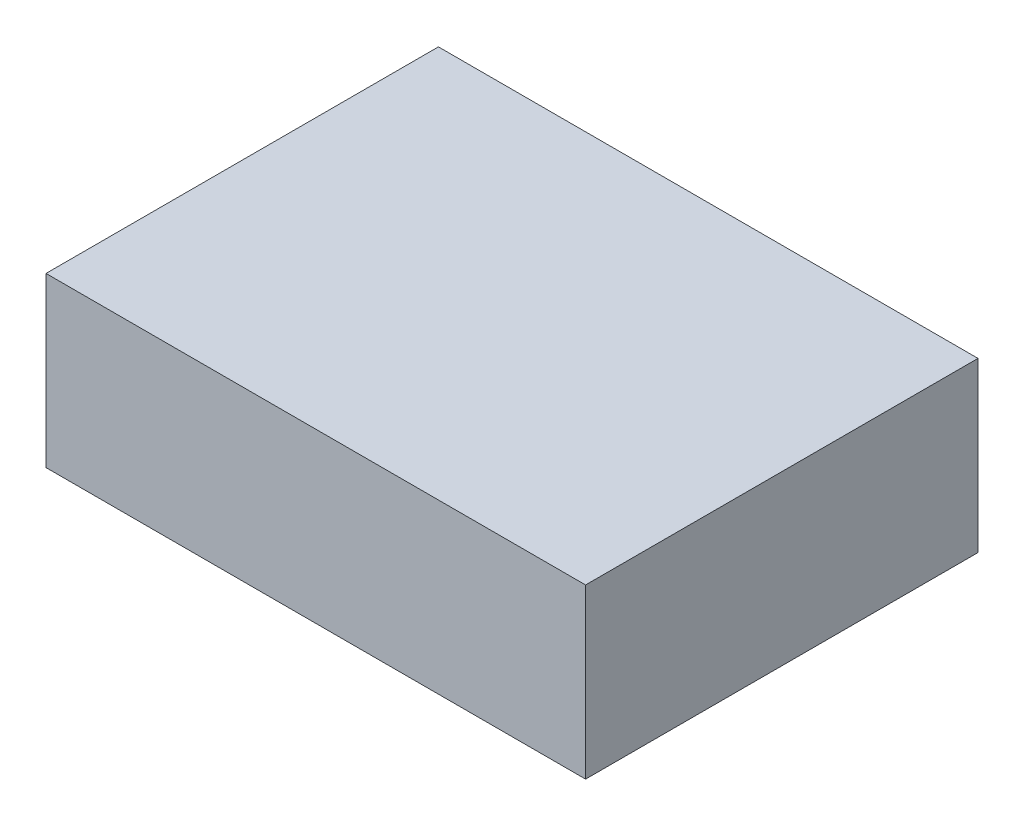
ISO-10303-21;
HEADER;
FILE_DESCRIPTION(('STEP AP214'),'2;1');
FILE_NAME('part.step','',(''),(''),'','','');
FILE_SCHEMA(('AUTOMOTIVE_DESIGN { 1 0 10303 214 1 1 1 1 }'));
ENDSEC;
DATA;
#1=APPLICATION_CONTEXT('core data for automotive mechanical design processes');
#2=APPLICATION_PROTOCOL_DEFINITION('international standard','automotive_design',2000,#1);
#3=PRODUCT_CONTEXT('',#1,'mechanical');
#4=PRODUCT('Part','Part','',(#3));
#5=PRODUCT_RELATED_PRODUCT_CATEGORY('part','',(#4));
#6=PRODUCT_DEFINITION_FORMATION('','',#4);
#7=PRODUCT_DEFINITION_CONTEXT('part definition',#1,'design');
#8=PRODUCT_DEFINITION('design','',#6,#7);
#9=PRODUCT_DEFINITION_SHAPE('','',#8);
#10=(LENGTH_UNIT() NAMED_UNIT(*) SI_UNIT(.MILLI.,.METRE.));
#11=(NAMED_UNIT(*) PLANE_ANGLE_UNIT() SI_UNIT($,.RADIAN.));
#12=(NAMED_UNIT(*) SI_UNIT($,.STERADIAN.) SOLID_ANGLE_UNIT());
#13=UNCERTAINTY_MEASURE_WITH_UNIT(LENGTH_MEASURE(1.E-05),#10,'distance_accuracy_value','');
#14=(GEOMETRIC_REPRESENTATION_CONTEXT(3) GLOBAL_UNCERTAINTY_ASSIGNED_CONTEXT((#13)) GLOBAL_UNIT_ASSIGNED_CONTEXT((#10,
#11,#12)) REPRESENTATION_CONTEXT('',''));
#15=CARTESIAN_POINT('',(0.,0.,0.));
#16=DIRECTION('',(0.,0.,1.));
#17=DIRECTION('',(1.,0.,0.));
#18=AXIS2_PLACEMENT_3D('',#15,#16,#17);
#19=CARTESIAN_POINT('',(0.,38.1,0.));
#20=DIRECTION('',(1.,0.,0.));
#21=DIRECTION('',(0.,0.,-1.));
#22=AXIS2_PLACEMENT_3D('',#19,#20,#21);
#23=PLANE('',#22);
#24=DIRECTION('',(0.,0.,1.));
#25=VECTOR('',#24,1.);
#26=CARTESIAN_POINT('',(0.,0.,0.));
#27=LINE('',#26,#25);
#28=CARTESIAN_POINT('',(0.,0.,-88.9));
#29=VERTEX_POINT('',#28);
#30=CARTESIAN_POINT('',(0.,0.,0.));
#31=VERTEX_POINT('',#30);
#32=EDGE_CURVE('E101',#29,#31,#27,.T.);
#33=ORIENTED_EDGE('',*,*,#32,.T.);
#34=DIRECTION('',(0.,-1.,0.));
#35=VECTOR('',#34,1.);
#36=CARTESIAN_POINT('',(0.,38.1,0.));
#37=LINE('',#36,#35);
#38=CARTESIAN_POINT('',(0.,38.1,0.));
#39=VERTEX_POINT('',#38);
#40=EDGE_CURVE('E11',#39,#31,#37,.T.);
#41=ORIENTED_EDGE('',*,*,#40,.F.);
#42=DIRECTION('',(0.,0.,1.));
#43=VECTOR('',#42,1.);
#44=CARTESIAN_POINT('',(0.,38.1,0.));
#45=LINE('',#44,#43);
#46=CARTESIAN_POINT('',(0.,38.1,-88.9));
#47=VERTEX_POINT('',#46);
#48=EDGE_CURVE('E89',#47,#39,#45,.T.);
#49=ORIENTED_EDGE('',*,*,#48,.F.);
#50=DIRECTION('',(0.,-1.,0.));
#51=VECTOR('',#50,1.);
#52=CARTESIAN_POINT('',(0.,38.1,-88.9));
#53=LINE('',#52,#51);
#54=EDGE_CURVE('E97',#47,#29,#53,.T.);
#55=ORIENTED_EDGE('',*,*,#54,.T.);
#56=EDGE_LOOP('',(#33,#41,#49,#55));
#57=FACE_BOUND('',#56,.T.);
#58=ADVANCED_FACE('F38',(#57),#23,.F.);
#59=CARTESIAN_POINT('',(0.,38.1,0.));
#60=DIRECTION('',(0.,0.,-1.));
#61=DIRECTION('',(-1.,0.,0.));
#62=AXIS2_PLACEMENT_3D('',#59,#60,#61);
#63=PLANE('',#62);
#64=DIRECTION('',(1.,0.,0.));
#65=VECTOR('',#64,1.);
#66=CARTESIAN_POINT('',(0.,0.,0.));
#67=LINE('',#66,#65);
#68=CARTESIAN_POINT('',(122.2375,0.,0.));
#69=VERTEX_POINT('',#68);
#70=EDGE_CURVE('E93',#31,#69,#67,.T.);
#71=ORIENTED_EDGE('',*,*,#70,.T.);
#72=DIRECTION('',(0.,-1.,0.));
#73=VECTOR('',#72,1.);
#74=CARTESIAN_POINT('',(122.2375,38.1,0.));
#75=LINE('',#74,#73);
#76=CARTESIAN_POINT('',(122.2375,38.1,0.));
#77=VERTEX_POINT('',#76);
#78=EDGE_CURVE('E46',#77,#69,#75,.T.);
#79=ORIENTED_EDGE('',*,*,#78,.F.);
#80=DIRECTION('',(1.,0.,0.));
#81=VECTOR('',#80,1.);
#82=CARTESIAN_POINT('',(0.,38.1,0.));
#83=LINE('',#82,#81);
#84=EDGE_CURVE('E84',#39,#77,#83,.T.);
#85=ORIENTED_EDGE('',*,*,#84,.F.);
#86=ORIENTED_EDGE('',*,*,#40,.T.);
#87=EDGE_LOOP('',(#71,#79,#85,#86));
#88=FACE_BOUND('',#87,.T.);
#89=ADVANCED_FACE('F92',(#88),#63,.F.);
#90=CARTESIAN_POINT('',(122.2375,38.1,0.));
#91=DIRECTION('',(-1.,0.,0.));
#92=DIRECTION('',(0.,0.,1.));
#93=AXIS2_PLACEMENT_3D('',#90,#91,#92);
#94=PLANE('',#93);
#95=DIRECTION('',(0.,0.,-1.));
#96=VECTOR('',#95,1.);
#97=CARTESIAN_POINT('',(122.2375,0.,0.));
#98=LINE('',#97,#96);
#99=CARTESIAN_POINT('',(122.2375,0.,-88.9));
#100=VERTEX_POINT('',#99);
#101=EDGE_CURVE('E71',#69,#100,#98,.T.);
#102=ORIENTED_EDGE('',*,*,#101,.T.);
#103=DIRECTION('',(0.,-1.,0.));
#104=VECTOR('',#103,1.);
#105=CARTESIAN_POINT('',(122.2375,38.1,-88.9));
#106=LINE('',#105,#104);
#107=CARTESIAN_POINT('',(122.2375,38.1,-88.9));
#108=VERTEX_POINT('',#107);
#109=EDGE_CURVE('E94',#108,#100,#106,.T.);
#110=ORIENTED_EDGE('',*,*,#109,.F.);
#111=DIRECTION('',(0.,0.,-1.));
#112=VECTOR('',#111,1.);
#113=CARTESIAN_POINT('',(122.2375,38.1,0.));
#114=LINE('',#113,#112);
#115=EDGE_CURVE('E87',#77,#108,#114,.T.);
#116=ORIENTED_EDGE('',*,*,#115,.F.);
#117=ORIENTED_EDGE('',*,*,#78,.T.);
#118=EDGE_LOOP('',(#102,#110,#116,#117));
#119=FACE_BOUND('',#118,.T.);
#120=ADVANCED_FACE('F95',(#119),#94,.F.);
#121=CARTESIAN_POINT('',(0.,38.1,-88.9));
#122=DIRECTION('',(0.,0.,1.));
#123=DIRECTION('',(1.,0.,0.));
#124=AXIS2_PLACEMENT_3D('',#121,#122,#123);
#125=PLANE('',#124);
#126=DIRECTION('',(-1.,0.,0.));
#127=VECTOR('',#126,1.);
#128=CARTESIAN_POINT('',(0.,0.,-88.9));
#129=LINE('',#128,#127);
#130=EDGE_CURVE('E77',#100,#29,#129,.T.);
#131=ORIENTED_EDGE('',*,*,#130,.T.);
#132=ORIENTED_EDGE('',*,*,#54,.F.);
#133=DIRECTION('',(-1.,0.,0.));
#134=VECTOR('',#133,1.);
#135=CARTESIAN_POINT('',(0.,38.1,-88.9));
#136=LINE('',#135,#134);
#137=EDGE_CURVE('E54',#108,#47,#136,.T.);
#138=ORIENTED_EDGE('',*,*,#137,.F.);
#139=ORIENTED_EDGE('',*,*,#109,.T.);
#140=EDGE_LOOP('',(#131,#132,#138,#139));
#141=FACE_BOUND('',#140,.T.);
#142=ADVANCED_FACE('F108',(#141),#125,.F.);
#143=CARTESIAN_POINT('',(0.,38.1,0.));
#144=DIRECTION('',(0.,-1.,0.));
#145=DIRECTION('',(0.,0.,-1.));
#146=AXIS2_PLACEMENT_3D('',#143,#144,#145);
#147=PLANE('',#146);
#148=ORIENTED_EDGE('',*,*,#48,.T.);
#149=ORIENTED_EDGE('',*,*,#84,.T.);
#150=ORIENTED_EDGE('',*,*,#115,.T.);
#151=ORIENTED_EDGE('',*,*,#137,.T.);
#152=EDGE_LOOP('',(#148,#149,#150,#151));
#153=FACE_BOUND('',#152,.T.);
#154=ADVANCED_FACE('F85',(#153),#147,.F.);
#155=CARTESIAN_POINT('',(0.,0.,0.));
#156=DIRECTION('',(0.,-1.,0.));
#157=DIRECTION('',(0.,0.,-1.));
#158=AXIS2_PLACEMENT_3D('',#155,#156,#157);
#159=PLANE('',#158);
#160=ORIENTED_EDGE('',*,*,#32,.F.);
#161=ORIENTED_EDGE('',*,*,#130,.F.);
#162=ORIENTED_EDGE('',*,*,#101,.F.);
#163=ORIENTED_EDGE('',*,*,#70,.F.);
#164=EDGE_LOOP('',(#160,#161,#162,#163));
#165=FACE_BOUND('',#164,.T.);
#166=ADVANCED_FACE('F111',(#165),#159,.T.);
#167=CLOSED_SHELL('',(#58,#89,#120,#142,#154,#166));
#168=MANIFOLD_SOLID_BREP('B2',#167);
#169=ADVANCED_BREP_SHAPE_REPRESENTATION('',(#18,#168),#14);
#170=SHAPE_DEFINITION_REPRESENTATION(#9,#169);
ENDSEC;
END-ISO-10303-21;
